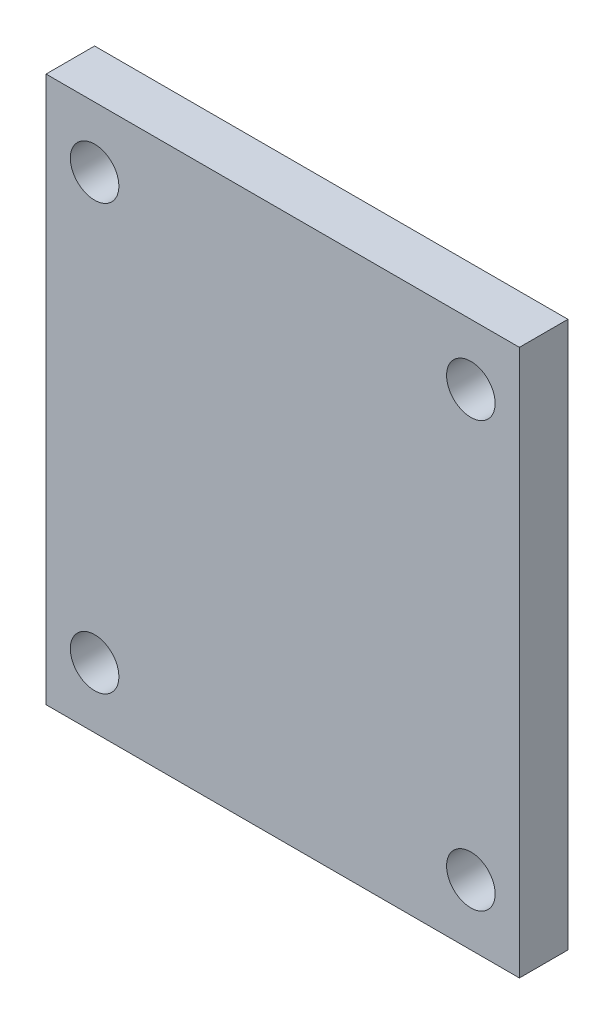
ISO-10303-21;
HEADER;
FILE_DESCRIPTION(('STEP AP214'),'2;1');
FILE_NAME('part.step','',(''),(''),'','','');
FILE_SCHEMA(('AUTOMOTIVE_DESIGN { 1 0 10303 214 1 1 1 1 }'));
ENDSEC;
DATA;
#1=APPLICATION_CONTEXT('core data for automotive mechanical design processes');
#2=APPLICATION_PROTOCOL_DEFINITION('international standard','automotive_design',2000,#1);
#3=PRODUCT_CONTEXT('',#1,'mechanical');
#4=PRODUCT('Part','Part','',(#3));
#5=PRODUCT_RELATED_PRODUCT_CATEGORY('part','',(#4));
#6=PRODUCT_DEFINITION_FORMATION('','',#4);
#7=PRODUCT_DEFINITION_CONTEXT('part definition',#1,'design');
#8=PRODUCT_DEFINITION('design','',#6,#7);
#9=PRODUCT_DEFINITION_SHAPE('','',#8);
#10=(LENGTH_UNIT() NAMED_UNIT(*) SI_UNIT(.MILLI.,.METRE.));
#11=(NAMED_UNIT(*) PLANE_ANGLE_UNIT() SI_UNIT($,.RADIAN.));
#12=(NAMED_UNIT(*) SI_UNIT($,.STERADIAN.) SOLID_ANGLE_UNIT());
#13=UNCERTAINTY_MEASURE_WITH_UNIT(LENGTH_MEASURE(1.E-05),#10,'distance_accuracy_value','');
#14=(GEOMETRIC_REPRESENTATION_CONTEXT(3) GLOBAL_UNCERTAINTY_ASSIGNED_CONTEXT((#13)) GLOBAL_UNIT_ASSIGNED_CONTEXT((#10,
#11,#12)) REPRESENTATION_CONTEXT('',''));
#15=CARTESIAN_POINT('',(0.,0.,0.));
#16=DIRECTION('',(0.,0.,1.));
#17=DIRECTION('',(1.,0.,0.));
#18=AXIS2_PLACEMENT_3D('',#15,#16,#17);
#19=CARTESIAN_POINT('',(0.,0.,4.));
#20=DIRECTION('',(0.,0.,1.));
#21=DIRECTION('',(1.,0.,0.));
#22=AXIS2_PLACEMENT_3D('',#19,#20,#21);
#23=PLANE('',#22);
#24=CARTESIAN_POINT('',(15.1164101424311,17.4041025356077,4.));
#25=DIRECTION('',(0.,0.,1.));
#26=DIRECTION('',(1.,0.,0.));
#27=AXIS2_PLACEMENT_3D('',#24,#25,#26);
#28=CIRCLE('',#27,2.);
#29=CARTESIAN_POINT('',(17.1164101424311,17.4041025356077,4.));
#30=VERTEX_POINT('',#29);
#31=EDGE_CURVE('E123',#30,#30,#28,.T.);
#32=ORIENTED_EDGE('',*,*,#31,.F.);
#33=EDGE_LOOP('',(#32));
#34=FACE_BOUND('',#33,.T.);
#35=CARTESIAN_POINT('',(-15.8835898575689,-17.5958974643922,4.));
#36=DIRECTION('',(0.,0.,1.));
#37=DIRECTION('',(1.,0.,0.));
#38=AXIS2_PLACEMENT_3D('',#35,#36,#37);
#39=CIRCLE('',#38,2.);
#40=CARTESIAN_POINT('',(-13.8835898575689,-17.5958974643922,4.));
#41=VERTEX_POINT('',#40);
#42=EDGE_CURVE('E102',#41,#41,#39,.T.);
#43=ORIENTED_EDGE('',*,*,#42,.F.);
#44=EDGE_LOOP('',(#43));
#45=FACE_BOUND('',#44,.T.);
#46=DIRECTION('',(0.,1.,0.));
#47=VECTOR('',#46,1.);
#48=CARTESIAN_POINT('',(19.1164101424311,-22.5958974643922,4.));
#49=LINE('',#48,#47);
#50=CARTESIAN_POINT('',(19.1164101424311,-22.5958974643922,4.));
#51=VERTEX_POINT('',#50);
#52=CARTESIAN_POINT('',(19.1164101424311,22.4041025356077,4.));
#53=VERTEX_POINT('',#52);
#54=EDGE_CURVE('E87',#51,#53,#49,.T.);
#55=ORIENTED_EDGE('',*,*,#54,.T.);
#56=DIRECTION('',(-1.,0.,0.));
#57=VECTOR('',#56,1.);
#58=CARTESIAN_POINT('',(19.1164101424311,22.4041025356077,4.));
#59=LINE('',#58,#57);
#60=CARTESIAN_POINT('',(-19.8835898575689,22.4041025356077,4.));
#61=VERTEX_POINT('',#60);
#62=EDGE_CURVE('E82',#53,#61,#59,.T.);
#63=ORIENTED_EDGE('',*,*,#62,.T.);
#64=DIRECTION('',(0.,-1.,0.));
#65=VECTOR('',#64,1.);
#66=CARTESIAN_POINT('',(-19.8835898575689,22.4041025356077,4.));
#67=LINE('',#66,#65);
#68=CARTESIAN_POINT('',(-19.8835898575689,-22.5958974643922,4.));
#69=VERTEX_POINT('',#68);
#70=EDGE_CURVE('E85',#61,#69,#67,.T.);
#71=ORIENTED_EDGE('',*,*,#70,.T.);
#72=DIRECTION('',(1.,0.,0.));
#73=VECTOR('',#72,1.);
#74=CARTESIAN_POINT('',(-19.8835898575689,-22.5958974643922,4.));
#75=LINE('',#74,#73);
#76=EDGE_CURVE('E52',#69,#51,#75,.T.);
#77=ORIENTED_EDGE('',*,*,#76,.T.);
#78=EDGE_LOOP('',(#55,#63,#71,#77));
#79=FACE_BOUND('',#78,.T.);
#80=CARTESIAN_POINT('',(15.1164101424311,-17.5958974643922,4.));
#81=DIRECTION('',(0.,0.,1.));
#82=DIRECTION('',(1.,0.,0.));
#83=AXIS2_PLACEMENT_3D('',#80,#81,#82);
#84=CIRCLE('',#83,2.);
#85=CARTESIAN_POINT('',(17.1164101424311,-17.5958974643922,4.));
#86=VERTEX_POINT('',#85);
#87=EDGE_CURVE('E117',#86,#86,#84,.T.);
#88=ORIENTED_EDGE('',*,*,#87,.F.);
#89=EDGE_LOOP('',(#88));
#90=FACE_BOUND('',#89,.T.);
#91=CARTESIAN_POINT('',(-15.8835898575689,17.4041025356078,4.));
#92=DIRECTION('',(0.,0.,1.));
#93=DIRECTION('',(1.,0.,0.));
#94=AXIS2_PLACEMENT_3D('',#91,#92,#93);
#95=CIRCLE('',#94,2.);
#96=CARTESIAN_POINT('',(-13.8835898575689,17.4041025356078,4.));
#97=VERTEX_POINT('',#96);
#98=EDGE_CURVE('E129',#97,#97,#95,.T.);
#99=ORIENTED_EDGE('',*,*,#98,.F.);
#100=EDGE_LOOP('',(#99));
#101=FACE_BOUND('',#100,.T.);
#102=ADVANCED_FACE('F35',(#34,#45,#79,#90,#101),#23,.T.);
#103=CARTESIAN_POINT('',(0.,0.,0.));
#104=DIRECTION('',(0.,0.,1.));
#105=DIRECTION('',(1.,0.,0.));
#106=AXIS2_PLACEMENT_3D('',#103,#104,#105);
#107=PLANE('',#106);
#108=DIRECTION('',(0.,1.,0.));
#109=VECTOR('',#108,1.);
#110=CARTESIAN_POINT('',(19.1164101424311,-22.5958974643922,0.));
#111=LINE('',#110,#109);
#112=CARTESIAN_POINT('',(19.1164101424311,-22.5958974643922,0.));
#113=VERTEX_POINT('',#112);
#114=CARTESIAN_POINT('',(19.1164101424311,22.4041025356077,0.));
#115=VERTEX_POINT('',#114);
#116=EDGE_CURVE('E99',#113,#115,#111,.T.);
#117=ORIENTED_EDGE('',*,*,#116,.F.);
#118=DIRECTION('',(1.,0.,0.));
#119=VECTOR('',#118,1.);
#120=CARTESIAN_POINT('',(-19.8835898575689,-22.5958974643922,0.));
#121=LINE('',#120,#119);
#122=CARTESIAN_POINT('',(-19.8835898575689,-22.5958974643922,0.));
#123=VERTEX_POINT('',#122);
#124=EDGE_CURVE('E75',#123,#113,#121,.T.);
#125=ORIENTED_EDGE('',*,*,#124,.F.);
#126=DIRECTION('',(0.,-1.,0.));
#127=VECTOR('',#126,1.);
#128=CARTESIAN_POINT('',(-19.8835898575689,22.4041025356077,0.));
#129=LINE('',#128,#127);
#130=CARTESIAN_POINT('',(-19.8835898575689,22.4041025356077,0.));
#131=VERTEX_POINT('',#130);
#132=EDGE_CURVE('E69',#131,#123,#129,.T.);
#133=ORIENTED_EDGE('',*,*,#132,.F.);
#134=DIRECTION('',(-1.,0.,0.));
#135=VECTOR('',#134,1.);
#136=CARTESIAN_POINT('',(19.1164101424311,22.4041025356077,0.));
#137=LINE('',#136,#135);
#138=EDGE_CURVE('E91',#115,#131,#137,.T.);
#139=ORIENTED_EDGE('',*,*,#138,.F.);
#140=EDGE_LOOP('',(#117,#125,#133,#139));
#141=FACE_BOUND('',#140,.T.);
#142=CARTESIAN_POINT('',(-15.8835898575689,-17.5958974643922,0.));
#143=DIRECTION('',(0.,0.,1.));
#144=DIRECTION('',(1.,0.,0.));
#145=AXIS2_PLACEMENT_3D('',#142,#143,#144);
#146=CIRCLE('',#145,2.);
#147=CARTESIAN_POINT('',(-13.8835898575689,-17.5958974643922,0.));
#148=VERTEX_POINT('',#147);
#149=EDGE_CURVE('E114',#148,#148,#146,.T.);
#150=ORIENTED_EDGE('',*,*,#149,.T.);
#151=EDGE_LOOP('',(#150));
#152=FACE_BOUND('',#151,.T.);
#153=CARTESIAN_POINT('',(15.1164101424311,-17.5958974643922,0.));
#154=DIRECTION('',(0.,0.,1.));
#155=DIRECTION('',(1.,0.,0.));
#156=AXIS2_PLACEMENT_3D('',#153,#154,#155);
#157=CIRCLE('',#156,2.);
#158=CARTESIAN_POINT('',(17.1164101424311,-17.5958974643922,0.));
#159=VERTEX_POINT('',#158);
#160=EDGE_CURVE('E120',#159,#159,#157,.T.);
#161=ORIENTED_EDGE('',*,*,#160,.T.);
#162=EDGE_LOOP('',(#161));
#163=FACE_BOUND('',#162,.T.);
#164=CARTESIAN_POINT('',(15.1164101424311,17.4041025356077,0.));
#165=DIRECTION('',(0.,0.,1.));
#166=DIRECTION('',(1.,0.,0.));
#167=AXIS2_PLACEMENT_3D('',#164,#165,#166);
#168=CIRCLE('',#167,2.);
#169=CARTESIAN_POINT('',(17.1164101424311,17.4041025356077,0.));
#170=VERTEX_POINT('',#169);
#171=EDGE_CURVE('E126',#170,#170,#168,.T.);
#172=ORIENTED_EDGE('',*,*,#171,.T.);
#173=EDGE_LOOP('',(#172));
#174=FACE_BOUND('',#173,.T.);
#175=CARTESIAN_POINT('',(-15.8835898575689,17.4041025356078,0.));
#176=DIRECTION('',(0.,0.,1.));
#177=DIRECTION('',(1.,0.,0.));
#178=AXIS2_PLACEMENT_3D('',#175,#176,#177);
#179=CIRCLE('',#178,2.);
#180=CARTESIAN_POINT('',(-13.8835898575689,17.4041025356078,0.));
#181=VERTEX_POINT('',#180);
#182=EDGE_CURVE('E132',#181,#181,#179,.T.);
#183=ORIENTED_EDGE('',*,*,#182,.T.);
#184=EDGE_LOOP('',(#183));
#185=FACE_BOUND('',#184,.T.);
#186=ADVANCED_FACE('F110',(#141,#152,#163,#174,#185),#107,.F.);
#187=CARTESIAN_POINT('',(19.1164101424311,-22.5958974643922,4.));
#188=DIRECTION('',(-1.,0.,0.));
#189=DIRECTION('',(0.,-1.,0.));
#190=AXIS2_PLACEMENT_3D('',#187,#188,#189);
#191=PLANE('',#190);
#192=ORIENTED_EDGE('',*,*,#116,.T.);
#193=DIRECTION('',(0.,0.,-1.));
#194=VECTOR('',#193,1.);
#195=CARTESIAN_POINT('',(19.1164101424311,22.4041025356077,4.));
#196=LINE('',#195,#194);
#197=EDGE_CURVE('E11',#53,#115,#196,.T.);
#198=ORIENTED_EDGE('',*,*,#197,.F.);
#199=ORIENTED_EDGE('',*,*,#54,.F.);
#200=DIRECTION('',(0.,0.,-1.));
#201=VECTOR('',#200,1.);
#202=CARTESIAN_POINT('',(19.1164101424311,-22.5958974643922,4.));
#203=LINE('',#202,#201);
#204=EDGE_CURVE('E95',#51,#113,#203,.T.);
#205=ORIENTED_EDGE('',*,*,#204,.T.);
#206=EDGE_LOOP('',(#192,#198,#199,#205));
#207=FACE_BOUND('',#206,.T.);
#208=ADVANCED_FACE('F37',(#207),#191,.F.);
#209=CARTESIAN_POINT('',(19.1164101424311,22.4041025356077,4.));
#210=DIRECTION('',(0.,-1.,0.));
#211=DIRECTION('',(1.,0.,0.));
#212=AXIS2_PLACEMENT_3D('',#209,#210,#211);
#213=PLANE('',#212);
#214=ORIENTED_EDGE('',*,*,#138,.T.);
#215=DIRECTION('',(0.,0.,-1.));
#216=VECTOR('',#215,1.);
#217=CARTESIAN_POINT('',(-19.8835898575689,22.4041025356077,4.));
#218=LINE('',#217,#216);
#219=EDGE_CURVE('E44',#61,#131,#218,.T.);
#220=ORIENTED_EDGE('',*,*,#219,.F.);
#221=ORIENTED_EDGE('',*,*,#62,.F.);
#222=ORIENTED_EDGE('',*,*,#197,.T.);
#223=EDGE_LOOP('',(#214,#220,#221,#222));
#224=FACE_BOUND('',#223,.T.);
#225=ADVANCED_FACE('F90',(#224),#213,.F.);
#226=CARTESIAN_POINT('',(-19.8835898575689,22.4041025356077,4.));
#227=DIRECTION('',(1.,0.,0.));
#228=DIRECTION('',(0.,1.,0.));
#229=AXIS2_PLACEMENT_3D('',#226,#227,#228);
#230=PLANE('',#229);
#231=ORIENTED_EDGE('',*,*,#132,.T.);
#232=DIRECTION('',(0.,0.,-1.));
#233=VECTOR('',#232,1.);
#234=CARTESIAN_POINT('',(-19.8835898575689,-22.5958974643922,4.));
#235=LINE('',#234,#233);
#236=EDGE_CURVE('E92',#69,#123,#235,.T.);
#237=ORIENTED_EDGE('',*,*,#236,.F.);
#238=ORIENTED_EDGE('',*,*,#70,.F.);
#239=ORIENTED_EDGE('',*,*,#219,.T.);
#240=EDGE_LOOP('',(#231,#237,#238,#239));
#241=FACE_BOUND('',#240,.T.);
#242=ADVANCED_FACE('F93',(#241),#230,.F.);
#243=CARTESIAN_POINT('',(-19.8835898575689,-22.5958974643922,4.));
#244=DIRECTION('',(0.,1.,0.));
#245=DIRECTION('',(-1.,0.,0.));
#246=AXIS2_PLACEMENT_3D('',#243,#244,#245);
#247=PLANE('',#246);
#248=ORIENTED_EDGE('',*,*,#124,.T.);
#249=ORIENTED_EDGE('',*,*,#204,.F.);
#250=ORIENTED_EDGE('',*,*,#76,.F.);
#251=ORIENTED_EDGE('',*,*,#236,.T.);
#252=EDGE_LOOP('',(#248,#249,#250,#251));
#253=FACE_BOUND('',#252,.T.);
#254=ADVANCED_FACE('F107',(#253),#247,.F.);
#255=CARTESIAN_POINT('',(-15.8835898575689,-17.5958974643922,4.));
#256=DIRECTION('',(0.,0.,-1.));
#257=DIRECTION('',(-1.,0.,0.));
#258=AXIS2_PLACEMENT_3D('',#255,#256,#257);
#259=CYLINDRICAL_SURFACE('',#258,2.);
#260=ORIENTED_EDGE('',*,*,#42,.T.);
#261=EDGE_LOOP('',(#260));
#262=FACE_BOUND('',#261,.T.);
#263=ORIENTED_EDGE('',*,*,#149,.F.);
#264=EDGE_LOOP('',(#263));
#265=FACE_BOUND('',#264,.T.);
#266=ADVANCED_FACE('F151',(#262,#265),#259,.F.);
#267=CARTESIAN_POINT('',(15.1164101424311,-17.5958974643922,4.));
#268=DIRECTION('',(0.,0.,-1.));
#269=DIRECTION('',(-1.,0.,0.));
#270=AXIS2_PLACEMENT_3D('',#267,#268,#269);
#271=CYLINDRICAL_SURFACE('',#270,2.);
#272=ORIENTED_EDGE('',*,*,#87,.T.);
#273=EDGE_LOOP('',(#272));
#274=FACE_BOUND('',#273,.T.);
#275=ORIENTED_EDGE('',*,*,#160,.F.);
#276=EDGE_LOOP('',(#275));
#277=FACE_BOUND('',#276,.T.);
#278=ADVANCED_FACE('F197',(#274,#277),#271,.F.);
#279=CARTESIAN_POINT('',(15.1164101424311,17.4041025356077,4.));
#280=DIRECTION('',(0.,0.,-1.));
#281=DIRECTION('',(-1.,0.,0.));
#282=AXIS2_PLACEMENT_3D('',#279,#280,#281);
#283=CYLINDRICAL_SURFACE('',#282,2.);
#284=ORIENTED_EDGE('',*,*,#31,.T.);
#285=EDGE_LOOP('',(#284));
#286=FACE_BOUND('',#285,.T.);
#287=ORIENTED_EDGE('',*,*,#171,.F.);
#288=EDGE_LOOP('',(#287));
#289=FACE_BOUND('',#288,.T.);
#290=ADVANCED_FACE('F205',(#286,#289),#283,.F.);
#291=CARTESIAN_POINT('',(-15.8835898575689,17.4041025356078,4.));
#292=DIRECTION('',(0.,0.,-1.));
#293=DIRECTION('',(-1.,0.,0.));
#294=AXIS2_PLACEMENT_3D('',#291,#292,#293);
#295=CYLINDRICAL_SURFACE('',#294,2.);
#296=ORIENTED_EDGE('',*,*,#98,.T.);
#297=EDGE_LOOP('',(#296));
#298=FACE_BOUND('',#297,.T.);
#299=ORIENTED_EDGE('',*,*,#182,.F.);
#300=EDGE_LOOP('',(#299));
#301=FACE_BOUND('',#300,.T.);
#302=ADVANCED_FACE('F138',(#298,#301),#295,.F.);
#303=CLOSED_SHELL('',(#102,#186,#208,#225,#242,#254,#266,#278,#290,#302));
#304=MANIFOLD_SOLID_BREP('B2',#303);
#305=ADVANCED_BREP_SHAPE_REPRESENTATION('',(#18,#304),#14);
#306=SHAPE_DEFINITION_REPRESENTATION(#9,#305);
ENDSEC;
END-ISO-10303-21;
